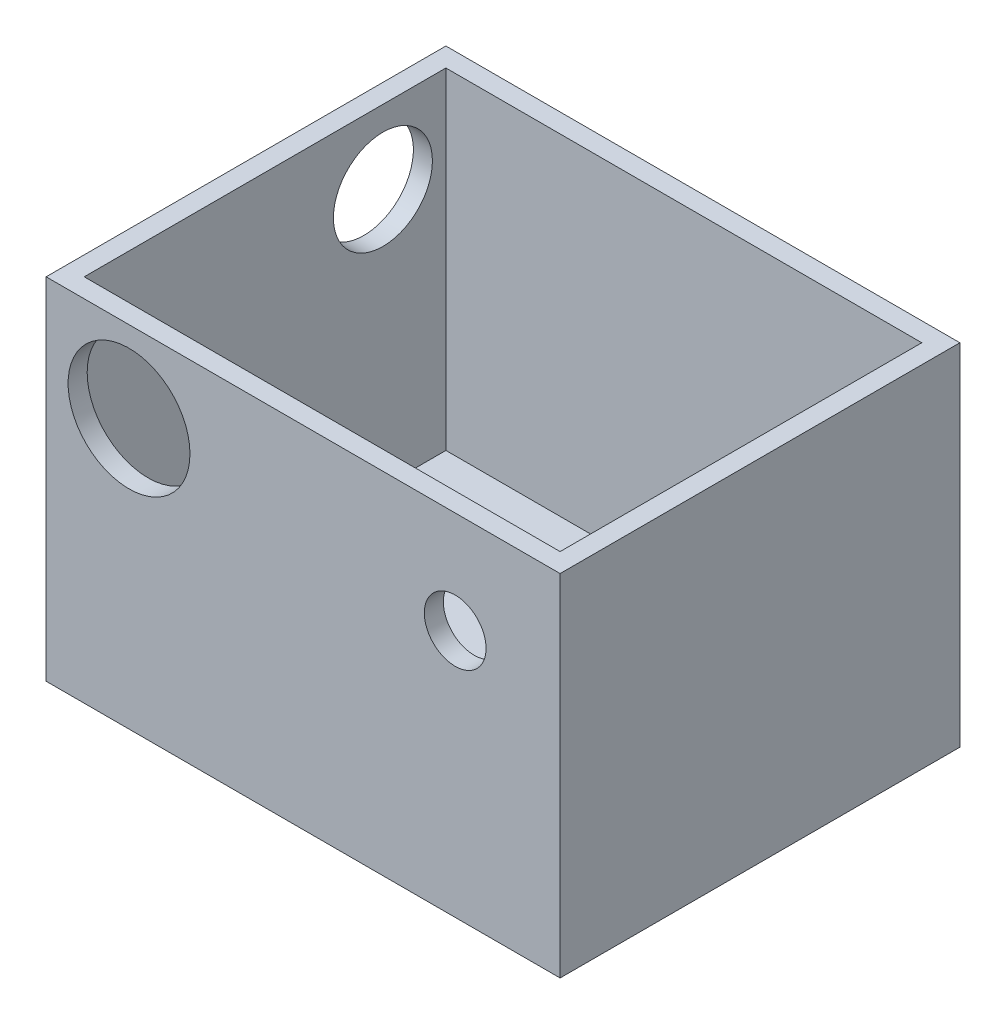
ISO-10303-21;
HEADER;
FILE_DESCRIPTION(('STEP AP214'),'2;1');
FILE_NAME('part.step','',(''),(''),'','','');
FILE_SCHEMA(('AUTOMOTIVE_DESIGN { 1 0 10303 214 1 1 1 1 }'));
ENDSEC;
DATA;
#1=APPLICATION_CONTEXT('core data for automotive mechanical design processes');
#2=APPLICATION_PROTOCOL_DEFINITION('international standard','automotive_design',2000,#1);
#3=PRODUCT_CONTEXT('',#1,'mechanical');
#4=PRODUCT('Part','Part','',(#3));
#5=PRODUCT_RELATED_PRODUCT_CATEGORY('part','',(#4));
#6=PRODUCT_DEFINITION_FORMATION('','',#4);
#7=PRODUCT_DEFINITION_CONTEXT('part definition',#1,'design');
#8=PRODUCT_DEFINITION('design','',#6,#7);
#9=PRODUCT_DEFINITION_SHAPE('','',#8);
#10=(LENGTH_UNIT() NAMED_UNIT(*) SI_UNIT(.MILLI.,.METRE.));
#11=(NAMED_UNIT(*) PLANE_ANGLE_UNIT() SI_UNIT($,.RADIAN.));
#12=(NAMED_UNIT(*) SI_UNIT($,.STERADIAN.) SOLID_ANGLE_UNIT());
#13=UNCERTAINTY_MEASURE_WITH_UNIT(LENGTH_MEASURE(1.E-05),#10,'distance_accuracy_value','');
#14=(GEOMETRIC_REPRESENTATION_CONTEXT(3) GLOBAL_UNCERTAINTY_ASSIGNED_CONTEXT((#13)) GLOBAL_UNIT_ASSIGNED_CONTEXT((#10,
#11,#12)) REPRESENTATION_CONTEXT('',''));
#15=CARTESIAN_POINT('',(0.,0.,0.));
#16=DIRECTION('',(0.,0.,1.));
#17=DIRECTION('',(1.,0.,0.));
#18=AXIS2_PLACEMENT_3D('',#15,#16,#17);
#19=CARTESIAN_POINT('',(-42.8625,58.42,-33.3375));
#20=DIRECTION('',(1.,0.,0.));
#21=DIRECTION('',(0.,0.,-1.));
#22=AXIS2_PLACEMENT_3D('',#19,#20,#21);
#23=PLANE('',#22);
#24=CARTESIAN_POINT('',(-42.8625,46.1469260644422,-19.6582067510548));
#25=DIRECTION('',(-1.,0.,0.));
#26=DIRECTION('',(0.,0.,1.));
#27=AXIS2_PLACEMENT_3D('',#24,#25,#26);
#28=CIRCLE('',#27,8.25500000000001);
#29=CARTESIAN_POINT('',(-42.8625,46.1469260644422,-11.4032067510548));
#30=VERTEX_POINT('',#29);
#31=EDGE_CURVE('E185',#30,#30,#28,.T.);
#32=ORIENTED_EDGE('',*,*,#31,.F.);
#33=EDGE_LOOP('',(#32));
#34=FACE_BOUND('',#33,.T.);
#35=DIRECTION('',(0.,0.,1.));
#36=VECTOR('',#35,1.);
#37=CARTESIAN_POINT('',(-42.8625,0.,-33.3375));
#38=LINE('',#37,#36);
#39=CARTESIAN_POINT('',(-42.8625,0.,-33.3375));
#40=VERTEX_POINT('',#39);
#41=CARTESIAN_POINT('',(-42.8625,0.,33.3375));
#42=VERTEX_POINT('',#41);
#43=EDGE_CURVE('E153',#40,#42,#38,.T.);
#44=ORIENTED_EDGE('',*,*,#43,.T.);
#45=DIRECTION('',(0.,-1.,0.));
#46=VECTOR('',#45,1.);
#47=CARTESIAN_POINT('',(-42.8625,58.42,33.3375));
#48=LINE('',#47,#46);
#49=CARTESIAN_POINT('',(-42.8625,58.42,33.3375));
#50=VERTEX_POINT('',#49);
#51=EDGE_CURVE('E11',#50,#42,#48,.T.);
#52=ORIENTED_EDGE('',*,*,#51,.F.);
#53=DIRECTION('',(0.,0.,1.));
#54=VECTOR('',#53,1.);
#55=CARTESIAN_POINT('',(-42.8625,58.42,-33.3375));
#56=LINE('',#55,#54);
#57=CARTESIAN_POINT('',(-42.8625,58.42,-33.3375));
#58=VERTEX_POINT('',#57);
#59=EDGE_CURVE('E144',#58,#50,#56,.T.);
#60=ORIENTED_EDGE('',*,*,#59,.F.);
#61=DIRECTION('',(0.,-1.,0.));
#62=VECTOR('',#61,1.);
#63=CARTESIAN_POINT('',(-42.8625,58.42,-33.3375));
#64=LINE('',#63,#62);
#65=EDGE_CURVE('E58',#58,#40,#64,.T.);
#66=ORIENTED_EDGE('',*,*,#65,.T.);
#67=EDGE_LOOP('',(#44,#52,#60,#66));
#68=FACE_BOUND('',#67,.T.);
#69=ADVANCED_FACE('F35',(#34,#68),#23,.F.);
#70=CARTESIAN_POINT('',(-42.8625,58.42,33.3375));
#71=DIRECTION('',(0.,0.,-1.));
#72=DIRECTION('',(-1.,0.,0.));
#73=AXIS2_PLACEMENT_3D('',#70,#71,#72);
#74=PLANE('',#73);
#75=CARTESIAN_POINT('',(25.3625,41.42,33.3375));
#76=DIRECTION('',(0.,0.,1.));
#77=DIRECTION('',(1.,0.,0.));
#78=AXIS2_PLACEMENT_3D('',#75,#76,#77);
#79=CIRCLE('',#78,5.15000000000002);
#80=CARTESIAN_POINT('',(30.5125,41.42,33.3375));
#81=VERTEX_POINT('',#80);
#82=EDGE_CURVE('E194',#81,#81,#79,.T.);
#83=ORIENTED_EDGE('',*,*,#82,.F.);
#84=EDGE_LOOP('',(#83));
#85=FACE_BOUND('',#84,.T.);
#86=CARTESIAN_POINT('',(-29.0334989565251,44.8588108969985,33.3375));
#87=DIRECTION('',(0.,0.,1.));
#88=DIRECTION('',(1.,0.,0.));
#89=AXIS2_PLACEMENT_3D('',#86,#87,#88);
#90=CIRCLE('',#89,10.16);
#91=CARTESIAN_POINT('',(-18.8734989565251,44.8588108969985,33.3375));
#92=VERTEX_POINT('',#91);
#93=EDGE_CURVE('E191',#92,#92,#90,.T.);
#94=ORIENTED_EDGE('',*,*,#93,.F.);
#95=EDGE_LOOP('',(#94));
#96=FACE_BOUND('',#95,.T.);
#97=DIRECTION('',(1.,0.,0.));
#98=VECTOR('',#97,1.);
#99=CARTESIAN_POINT('',(-42.8625,0.,33.3375));
#100=LINE('',#99,#98);
#101=CARTESIAN_POINT('',(42.8625,0.,33.3375));
#102=VERTEX_POINT('',#101);
#103=EDGE_CURVE('E155',#42,#102,#100,.T.);
#104=ORIENTED_EDGE('',*,*,#103,.T.);
#105=DIRECTION('',(0.,-1.,0.));
#106=VECTOR('',#105,1.);
#107=CARTESIAN_POINT('',(42.8625,58.42,33.3375));
#108=LINE('',#107,#106);
#109=CARTESIAN_POINT('',(42.8625,58.42,33.3375));
#110=VERTEX_POINT('',#109);
#111=EDGE_CURVE('E42',#110,#102,#108,.T.);
#112=ORIENTED_EDGE('',*,*,#111,.F.);
#113=DIRECTION('',(1.,0.,0.));
#114=VECTOR('',#113,1.);
#115=CARTESIAN_POINT('',(-42.8625,58.42,33.3375));
#116=LINE('',#115,#114);
#117=EDGE_CURVE('E84',#50,#110,#116,.T.);
#118=ORIENTED_EDGE('',*,*,#117,.F.);
#119=ORIENTED_EDGE('',*,*,#51,.T.);
#120=EDGE_LOOP('',(#104,#112,#118,#119));
#121=FACE_BOUND('',#120,.T.);
#122=ADVANCED_FACE('F169',(#85,#96,#121),#74,.F.);
#123=CARTESIAN_POINT('',(42.8625,58.42,-33.3375));
#124=DIRECTION('',(1.,0.,0.));
#125=DIRECTION('',(0.,0.,-1.));
#126=AXIS2_PLACEMENT_3D('',#123,#124,#125);
#127=PLANE('',#126);
#128=DIRECTION('',(0.,0.,1.));
#129=VECTOR('',#128,1.);
#130=CARTESIAN_POINT('',(42.8625,0.,-33.3375));
#131=LINE('',#130,#129);
#132=CARTESIAN_POINT('',(42.8625,0.,-33.3375));
#133=VERTEX_POINT('',#132);
#134=EDGE_CURVE('E158',#133,#102,#131,.T.);
#135=ORIENTED_EDGE('',*,*,#134,.F.);
#136=DIRECTION('',(0.,-1.,0.));
#137=VECTOR('',#136,1.);
#138=CARTESIAN_POINT('',(42.8625,58.42,-33.3375));
#139=LINE('',#138,#137);
#140=CARTESIAN_POINT('',(42.8625,58.42,-33.3375));
#141=VERTEX_POINT('',#140);
#142=EDGE_CURVE('E164',#141,#133,#139,.T.);
#143=ORIENTED_EDGE('',*,*,#142,.F.);
#144=DIRECTION('',(0.,0.,1.));
#145=VECTOR('',#144,1.);
#146=CARTESIAN_POINT('',(42.8625,58.42,-33.3375));
#147=LINE('',#146,#145);
#148=EDGE_CURVE('E148',#141,#110,#147,.T.);
#149=ORIENTED_EDGE('',*,*,#148,.T.);
#150=ORIENTED_EDGE('',*,*,#111,.T.);
#151=EDGE_LOOP('',(#135,#143,#149,#150));
#152=FACE_BOUND('',#151,.T.);
#153=ADVANCED_FACE('F167',(#152),#127,.T.);
#154=CARTESIAN_POINT('',(-42.8625,58.42,-33.3375));
#155=DIRECTION('',(0.,0.,-1.));
#156=DIRECTION('',(-1.,0.,0.));
#157=AXIS2_PLACEMENT_3D('',#154,#155,#156);
#158=PLANE('',#157);
#159=DIRECTION('',(1.,0.,0.));
#160=VECTOR('',#159,1.);
#161=CARTESIAN_POINT('',(-42.8625,0.,-33.3375));
#162=LINE('',#161,#160);
#163=EDGE_CURVE('E146',#40,#133,#162,.T.);
#164=ORIENTED_EDGE('',*,*,#163,.F.);
#165=ORIENTED_EDGE('',*,*,#65,.F.);
#166=DIRECTION('',(1.,0.,0.));
#167=VECTOR('',#166,1.);
#168=CARTESIAN_POINT('',(-42.8625,58.42,-33.3375));
#169=LINE('',#168,#167);
#170=EDGE_CURVE('E151',#58,#141,#169,.T.);
#171=ORIENTED_EDGE('',*,*,#170,.T.);
#172=ORIENTED_EDGE('',*,*,#142,.T.);
#173=EDGE_LOOP('',(#164,#165,#171,#172));
#174=FACE_BOUND('',#173,.T.);
#175=ADVANCED_FACE('F173',(#174),#158,.T.);
#176=CARTESIAN_POINT('',(0.,58.42,0.));
#177=DIRECTION('',(0.,1.,0.));
#178=DIRECTION('',(0.,0.,1.));
#179=AXIS2_PLACEMENT_3D('',#176,#177,#178);
#180=PLANE('',#179);
#181=DIRECTION('',(0.,0.,1.));
#182=VECTOR('',#181,1.);
#183=CARTESIAN_POINT('',(-39.6875,58.42,-33.3375));
#184=LINE('',#183,#182);
#185=CARTESIAN_POINT('',(-39.6875,58.42,-30.1625));
#186=VERTEX_POINT('',#185);
#187=CARTESIAN_POINT('',(-39.6875,58.42,30.1625));
#188=VERTEX_POINT('',#187);
#189=EDGE_CURVE('E134',#186,#188,#184,.T.);
#190=ORIENTED_EDGE('',*,*,#189,.F.);
#191=DIRECTION('',(1.,0.,0.));
#192=VECTOR('',#191,1.);
#193=CARTESIAN_POINT('',(-42.8625,58.42,-30.1625));
#194=LINE('',#193,#192);
#195=CARTESIAN_POINT('',(39.6875,58.42,-30.1625));
#196=VERTEX_POINT('',#195);
#197=EDGE_CURVE('E114',#186,#196,#194,.T.);
#198=ORIENTED_EDGE('',*,*,#197,.T.);
#199=DIRECTION('',(0.,0.,1.));
#200=VECTOR('',#199,1.);
#201=CARTESIAN_POINT('',(39.6875,58.42,-33.3375));
#202=LINE('',#201,#200);
#203=CARTESIAN_POINT('',(39.6875,58.42,30.1625));
#204=VERTEX_POINT('',#203);
#205=EDGE_CURVE('E49',#196,#204,#202,.T.);
#206=ORIENTED_EDGE('',*,*,#205,.T.);
#207=DIRECTION('',(1.,0.,0.));
#208=VECTOR('',#207,1.);
#209=CARTESIAN_POINT('',(-42.8625,58.42,30.1625));
#210=LINE('',#209,#208);
#211=EDGE_CURVE('E136',#188,#204,#210,.T.);
#212=ORIENTED_EDGE('',*,*,#211,.F.);
#213=EDGE_LOOP('',(#190,#198,#206,#212));
#214=FACE_BOUND('',#213,.T.);
#215=ORIENTED_EDGE('',*,*,#59,.T.);
#216=ORIENTED_EDGE('',*,*,#117,.T.);
#217=ORIENTED_EDGE('',*,*,#148,.F.);
#218=ORIENTED_EDGE('',*,*,#170,.F.);
#219=EDGE_LOOP('',(#215,#216,#217,#218));
#220=FACE_BOUND('',#219,.T.);
#221=ADVANCED_FACE('F176',(#214,#220),#180,.T.);
#222=CARTESIAN_POINT('',(0.,0.,0.));
#223=DIRECTION('',(0.,1.,0.));
#224=DIRECTION('',(0.,0.,1.));
#225=AXIS2_PLACEMENT_3D('',#222,#223,#224);
#226=PLANE('',#225);
#227=ORIENTED_EDGE('',*,*,#43,.F.);
#228=ORIENTED_EDGE('',*,*,#163,.T.);
#229=ORIENTED_EDGE('',*,*,#134,.T.);
#230=ORIENTED_EDGE('',*,*,#103,.F.);
#231=EDGE_LOOP('',(#227,#228,#229,#230));
#232=FACE_BOUND('',#231,.T.);
#233=ADVANCED_FACE('F172',(#232),#226,.F.);
#234=CARTESIAN_POINT('',(-39.6875,58.42,-33.3375));
#235=DIRECTION('',(1.,0.,0.));
#236=DIRECTION('',(0.,0.,-1.));
#237=AXIS2_PLACEMENT_3D('',#234,#235,#236);
#238=PLANE('',#237);
#239=CARTESIAN_POINT('',(-39.6875,46.1469260644422,-19.6582067510548));
#240=DIRECTION('',(1.,0.,0.));
#241=DIRECTION('',(0.,0.,-1.));
#242=AXIS2_PLACEMENT_3D('',#239,#240,#241);
#243=CIRCLE('',#242,8.25500000000001);
#244=CARTESIAN_POINT('',(-39.6875,46.1469260644422,-27.9132067510549));
#245=VERTEX_POINT('',#244);
#246=EDGE_CURVE('E187',#245,#245,#243,.T.);
#247=ORIENTED_EDGE('',*,*,#246,.F.);
#248=EDGE_LOOP('',(#247));
#249=FACE_BOUND('',#248,.T.);
#250=DIRECTION('',(0.,0.,1.));
#251=VECTOR('',#250,1.);
#252=CARTESIAN_POINT('',(-39.6875,3.175,-33.3375));
#253=LINE('',#252,#251);
#254=CARTESIAN_POINT('',(-39.6875,3.175,-30.1625));
#255=VERTEX_POINT('',#254);
#256=CARTESIAN_POINT('',(-39.6875,3.175,30.1625));
#257=VERTEX_POINT('',#256);
#258=EDGE_CURVE('E121',#255,#257,#253,.T.);
#259=ORIENTED_EDGE('',*,*,#258,.F.);
#260=DIRECTION('',(0.,-1.,0.));
#261=VECTOR('',#260,1.);
#262=CARTESIAN_POINT('',(-39.6875,58.42,-30.1625));
#263=LINE('',#262,#261);
#264=EDGE_CURVE('E108',#186,#255,#263,.T.);
#265=ORIENTED_EDGE('',*,*,#264,.F.);
#266=ORIENTED_EDGE('',*,*,#189,.T.);
#267=DIRECTION('',(0.,-1.,0.));
#268=VECTOR('',#267,1.);
#269=CARTESIAN_POINT('',(-39.6875,58.42,30.1625));
#270=LINE('',#269,#268);
#271=EDGE_CURVE('E124',#188,#257,#270,.T.);
#272=ORIENTED_EDGE('',*,*,#271,.T.);
#273=EDGE_LOOP('',(#259,#265,#266,#272));
#274=FACE_BOUND('',#273,.T.);
#275=ADVANCED_FACE('F122',(#249,#274),#238,.T.);
#276=CARTESIAN_POINT('',(-42.8625,58.42,30.1625));
#277=DIRECTION('',(0.,0.,-1.));
#278=DIRECTION('',(-1.,0.,0.));
#279=AXIS2_PLACEMENT_3D('',#276,#277,#278);
#280=PLANE('',#279);
#281=CARTESIAN_POINT('',(25.3625,41.42,30.1625));
#282=DIRECTION('',(0.,0.,-1.));
#283=DIRECTION('',(-1.,0.,0.));
#284=AXIS2_PLACEMENT_3D('',#281,#282,#283);
#285=CIRCLE('',#284,5.15000000000002);
#286=CARTESIAN_POINT('',(20.2125,41.42,30.1625));
#287=VERTEX_POINT('',#286);
#288=EDGE_CURVE('E188',#287,#287,#285,.T.);
#289=ORIENTED_EDGE('',*,*,#288,.F.);
#290=EDGE_LOOP('',(#289));
#291=FACE_BOUND('',#290,.T.);
#292=CARTESIAN_POINT('',(-29.0334989565251,44.8588108969985,30.1625));
#293=DIRECTION('',(0.,0.,-1.));
#294=DIRECTION('',(-1.,0.,0.));
#295=AXIS2_PLACEMENT_3D('',#292,#293,#294);
#296=CIRCLE('',#295,10.16);
#297=CARTESIAN_POINT('',(-39.1934989565251,44.8588108969985,30.1625));
#298=VERTEX_POINT('',#297);
#299=EDGE_CURVE('E128',#298,#298,#296,.T.);
#300=ORIENTED_EDGE('',*,*,#299,.F.);
#301=EDGE_LOOP('',(#300));
#302=FACE_BOUND('',#301,.T.);
#303=DIRECTION('',(1.,0.,0.));
#304=VECTOR('',#303,1.);
#305=CARTESIAN_POINT('',(-42.8625,3.175,30.1625));
#306=LINE('',#305,#304);
#307=CARTESIAN_POINT('',(39.6875,3.175,30.1625));
#308=VERTEX_POINT('',#307);
#309=EDGE_CURVE('E127',#257,#308,#306,.T.);
#310=ORIENTED_EDGE('',*,*,#309,.F.);
#311=ORIENTED_EDGE('',*,*,#271,.F.);
#312=ORIENTED_EDGE('',*,*,#211,.T.);
#313=DIRECTION('',(0.,-1.,0.));
#314=VECTOR('',#313,1.);
#315=CARTESIAN_POINT('',(39.6875,58.42,30.1625));
#316=LINE('',#315,#314);
#317=EDGE_CURVE('E202',#204,#308,#316,.T.);
#318=ORIENTED_EDGE('',*,*,#317,.T.);
#319=EDGE_LOOP('',(#310,#311,#312,#318));
#320=FACE_BOUND('',#319,.T.);
#321=ADVANCED_FACE('F209',(#291,#302,#320),#280,.T.);
#322=CARTESIAN_POINT('',(39.6875,58.42,-33.3375));
#323=DIRECTION('',(1.,0.,0.));
#324=DIRECTION('',(0.,0.,-1.));
#325=AXIS2_PLACEMENT_3D('',#322,#323,#324);
#326=PLANE('',#325);
#327=DIRECTION('',(0.,0.,1.));
#328=VECTOR('',#327,1.);
#329=CARTESIAN_POINT('',(39.6875,3.175,-33.3375));
#330=LINE('',#329,#328);
#331=CARTESIAN_POINT('',(39.6875,3.175,-30.1625));
#332=VERTEX_POINT('',#331);
#333=EDGE_CURVE('E133',#332,#308,#330,.T.);
#334=ORIENTED_EDGE('',*,*,#333,.T.);
#335=ORIENTED_EDGE('',*,*,#317,.F.);
#336=ORIENTED_EDGE('',*,*,#205,.F.);
#337=DIRECTION('',(0.,-1.,0.));
#338=VECTOR('',#337,1.);
#339=CARTESIAN_POINT('',(39.6875,58.42,-30.1625));
#340=LINE('',#339,#338);
#341=EDGE_CURVE('E117',#196,#332,#340,.T.);
#342=ORIENTED_EDGE('',*,*,#341,.T.);
#343=EDGE_LOOP('',(#334,#335,#336,#342));
#344=FACE_BOUND('',#343,.T.);
#345=ADVANCED_FACE('F206',(#344),#326,.F.);
#346=CARTESIAN_POINT('',(-42.8625,58.42,-30.1625));
#347=DIRECTION('',(0.,0.,-1.));
#348=DIRECTION('',(-1.,0.,0.));
#349=AXIS2_PLACEMENT_3D('',#346,#347,#348);
#350=PLANE('',#349);
#351=DIRECTION('',(1.,0.,0.));
#352=VECTOR('',#351,1.);
#353=CARTESIAN_POINT('',(-42.8625,3.175,-30.1625));
#354=LINE('',#353,#352);
#355=EDGE_CURVE('E112',#255,#332,#354,.T.);
#356=ORIENTED_EDGE('',*,*,#355,.T.);
#357=ORIENTED_EDGE('',*,*,#341,.F.);
#358=ORIENTED_EDGE('',*,*,#197,.F.);
#359=ORIENTED_EDGE('',*,*,#264,.T.);
#360=EDGE_LOOP('',(#356,#357,#358,#359));
#361=FACE_BOUND('',#360,.T.);
#362=ADVANCED_FACE('F110',(#361),#350,.F.);
#363=CARTESIAN_POINT('',(0.,3.175,0.));
#364=DIRECTION('',(0.,1.,0.));
#365=DIRECTION('',(0.,0.,1.));
#366=AXIS2_PLACEMENT_3D('',#363,#364,#365);
#367=PLANE('',#366);
#368=ORIENTED_EDGE('',*,*,#258,.T.);
#369=ORIENTED_EDGE('',*,*,#309,.T.);
#370=ORIENTED_EDGE('',*,*,#333,.F.);
#371=ORIENTED_EDGE('',*,*,#355,.F.);
#372=EDGE_LOOP('',(#368,#369,#370,#371));
#373=FACE_BOUND('',#372,.T.);
#374=ADVANCED_FACE('F131',(#373),#367,.T.);
#375=CARTESIAN_POINT('',(-29.0334989565251,44.8588108969985,33.3375));
#376=DIRECTION('',(0.,0.,1.));
#377=DIRECTION('',(1.,0.,0.));
#378=AXIS2_PLACEMENT_3D('',#375,#376,#377);
#379=CYLINDRICAL_SURFACE('',#378,10.16);
#380=ORIENTED_EDGE('',*,*,#93,.T.);
#381=EDGE_LOOP('',(#380));
#382=FACE_BOUND('',#381,.T.);
#383=ORIENTED_EDGE('',*,*,#299,.T.);
#384=EDGE_LOOP('',(#383));
#385=FACE_BOUND('',#384,.T.);
#386=ADVANCED_FACE('F228',(#382,#385),#379,.F.);
#387=CARTESIAN_POINT('',(-42.8625,46.1469260644422,-19.6582067510548));
#388=DIRECTION('',(-1.,0.,0.));
#389=DIRECTION('',(0.,0.,1.));
#390=AXIS2_PLACEMENT_3D('',#387,#388,#389);
#391=CYLINDRICAL_SURFACE('',#390,8.25500000000001);
#392=ORIENTED_EDGE('',*,*,#31,.T.);
#393=EDGE_LOOP('',(#392));
#394=FACE_BOUND('',#393,.T.);
#395=ORIENTED_EDGE('',*,*,#246,.T.);
#396=EDGE_LOOP('',(#395));
#397=FACE_BOUND('',#396,.T.);
#398=ADVANCED_FACE('F266',(#394,#397),#391,.F.);
#399=CARTESIAN_POINT('',(25.3625,41.42,33.3375));
#400=DIRECTION('',(0.,0.,1.));
#401=DIRECTION('',(1.,0.,0.));
#402=AXIS2_PLACEMENT_3D('',#399,#400,#401);
#403=CYLINDRICAL_SURFACE('',#402,5.15000000000002);
#404=ORIENTED_EDGE('',*,*,#82,.T.);
#405=EDGE_LOOP('',(#404));
#406=FACE_BOUND('',#405,.T.);
#407=ORIENTED_EDGE('',*,*,#288,.T.);
#408=EDGE_LOOP('',(#407));
#409=FACE_BOUND('',#408,.T.);
#410=ADVANCED_FACE('F270',(#406,#409),#403,.F.);
#411=CLOSED_SHELL('',(#69,#122,#153,#175,#221,#233,#275,#321,#345,#362,#374,#386,#398,#410));
#412=MANIFOLD_SOLID_BREP('B2',#411);
#413=ADVANCED_BREP_SHAPE_REPRESENTATION('',(#18,#412),#14);
#414=SHAPE_DEFINITION_REPRESENTATION(#9,#413);
ENDSEC;
END-ISO-10303-21;
